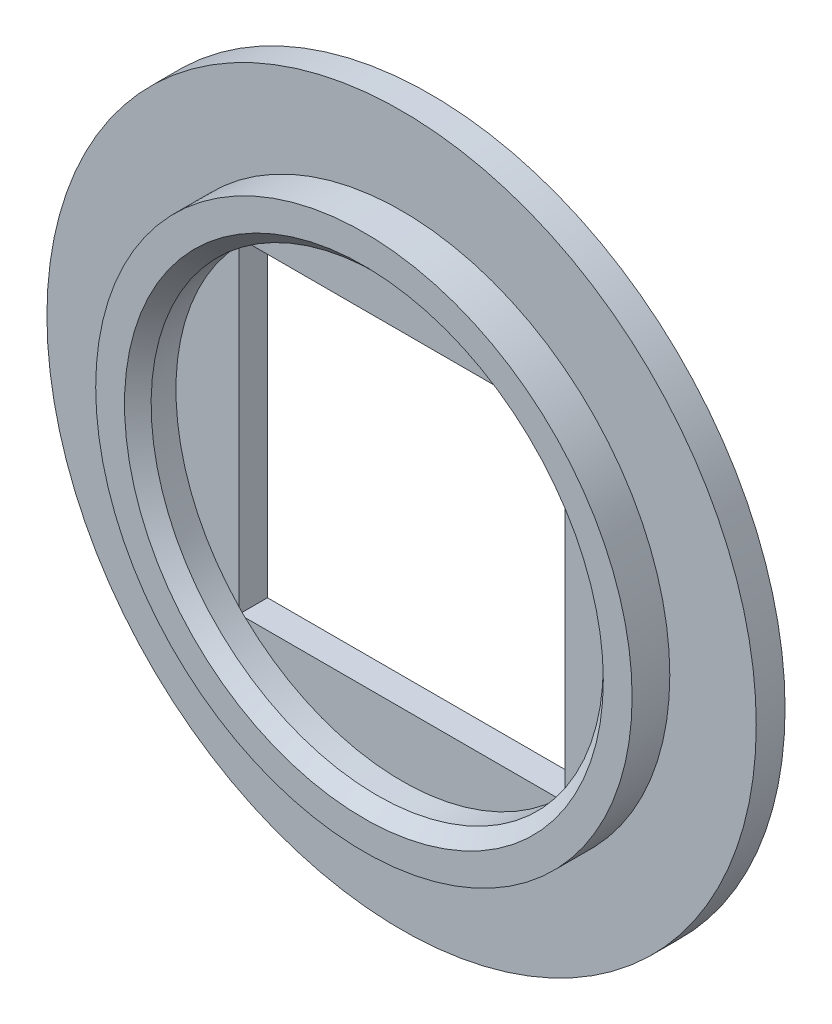
ISO-10303-21;
HEADER;
FILE_DESCRIPTION(('STEP AP214'),'2;1');
FILE_NAME('part.step','',(''),(''),'','','');
FILE_SCHEMA(('AUTOMOTIVE_DESIGN { 1 0 10303 214 1 1 1 1 }'));
ENDSEC;
DATA;
#1=APPLICATION_CONTEXT('core data for automotive mechanical design processes');
#2=APPLICATION_PROTOCOL_DEFINITION('international standard','automotive_design',2000,#1);
#3=PRODUCT_CONTEXT('',#1,'mechanical');
#4=PRODUCT('Part','Part','',(#3));
#5=PRODUCT_RELATED_PRODUCT_CATEGORY('part','',(#4));
#6=PRODUCT_DEFINITION_FORMATION('','',#4);
#7=PRODUCT_DEFINITION_CONTEXT('part definition',#1,'design');
#8=PRODUCT_DEFINITION('design','',#6,#7);
#9=PRODUCT_DEFINITION_SHAPE('','',#8);
#10=(LENGTH_UNIT() NAMED_UNIT(*) SI_UNIT(.MILLI.,.METRE.));
#11=(NAMED_UNIT(*) PLANE_ANGLE_UNIT() SI_UNIT($,.RADIAN.));
#12=(NAMED_UNIT(*) SI_UNIT($,.STERADIAN.) SOLID_ANGLE_UNIT());
#13=UNCERTAINTY_MEASURE_WITH_UNIT(LENGTH_MEASURE(1.E-05),#10,'distance_accuracy_value','');
#14=(GEOMETRIC_REPRESENTATION_CONTEXT(3) GLOBAL_UNCERTAINTY_ASSIGNED_CONTEXT((#13)) GLOBAL_UNIT_ASSIGNED_CONTEXT((#10,
#11,#12)) REPRESENTATION_CONTEXT('',''));
#15=CARTESIAN_POINT('',(0.,0.,0.));
#16=DIRECTION('',(0.,0.,1.));
#17=DIRECTION('',(1.,0.,0.));
#18=AXIS2_PLACEMENT_3D('',#15,#16,#17);
#19=CARTESIAN_POINT('',(0.,0.,0.64));
#20=DIRECTION('',(0.,0.,1.));
#21=DIRECTION('',(1.,0.,0.));
#22=AXIS2_PLACEMENT_3D('',#19,#20,#21);
#23=PLANE('',#22);
#24=DIRECTION('',(-1.,0.,0.));
#25=VECTOR('',#24,1.);
#26=CARTESIAN_POINT('',(-3.675,3.675,0.64));
#27=LINE('',#26,#25);
#28=CARTESIAN_POINT('',(3.53615257023788,3.675,0.64));
#29=VERTEX_POINT('',#28);
#30=CARTESIAN_POINT('',(-3.53615257023788,3.675,0.64));
#31=VERTEX_POINT('',#30);
#32=EDGE_CURVE('E143',#29,#31,#27,.T.);
#33=ORIENTED_EDGE('',*,*,#32,.F.);
#34=CARTESIAN_POINT('',(0.,0.,0.64));
#35=DIRECTION('',(0.,0.,1.));
#36=DIRECTION('',(1.,0.,0.));
#37=AXIS2_PLACEMENT_3D('',#34,#35,#36);
#38=CIRCLE('',#37,5.1);
#39=EDGE_CURVE('E216',#29,#31,#38,.T.);
#40=ORIENTED_EDGE('',*,*,#39,.T.);
#41=EDGE_LOOP('',(#33,#40));
#42=FACE_BOUND('',#41,.T.);
#43=ADVANCED_FACE('F45',(#42),#23,.T.);
#44=DIRECTION('',(0.,-1.,0.));
#45=VECTOR('',#44,1.);
#46=CARTESIAN_POINT('',(-3.675,0.,0.64));
#47=LINE('',#46,#45);
#48=CARTESIAN_POINT('',(-3.675,3.53615257023788,0.64));
#49=VERTEX_POINT('',#48);
#50=CARTESIAN_POINT('',(-3.675,-3.53615257023788,0.64));
#51=VERTEX_POINT('',#50);
#52=EDGE_CURVE('E150',#49,#51,#47,.T.);
#53=ORIENTED_EDGE('',*,*,#52,.F.);
#54=EDGE_CURVE('E204',#49,#51,#38,.T.);
#55=ORIENTED_EDGE('',*,*,#54,.T.);
#56=EDGE_LOOP('',(#53,#55));
#57=FACE_BOUND('',#56,.T.);
#58=ADVANCED_FACE('F210',(#57),#23,.T.);
#59=DIRECTION('',(1.,0.,0.));
#60=VECTOR('',#59,1.);
#61=CARTESIAN_POINT('',(3.675,-3.675,0.64));
#62=LINE('',#61,#60);
#63=CARTESIAN_POINT('',(-3.53615257023788,-3.675,0.64));
#64=VERTEX_POINT('',#63);
#65=CARTESIAN_POINT('',(3.53615257023788,-3.675,0.64));
#66=VERTEX_POINT('',#65);
#67=EDGE_CURVE('E180',#64,#66,#62,.T.);
#68=ORIENTED_EDGE('',*,*,#67,.F.);
#69=EDGE_CURVE('E207',#64,#66,#38,.T.);
#70=ORIENTED_EDGE('',*,*,#69,.T.);
#71=EDGE_LOOP('',(#68,#70));
#72=FACE_BOUND('',#71,.T.);
#73=ADVANCED_FACE('F256',(#72),#23,.T.);
#74=CARTESIAN_POINT('',(0.,0.,0.));
#75=DIRECTION('',(0.,0.,1.));
#76=DIRECTION('',(1.,0.,0.));
#77=AXIS2_PLACEMENT_3D('',#74,#75,#76);
#78=PLANE('',#77);
#79=CARTESIAN_POINT('',(0.,0.,0.));
#80=DIRECTION('',(0.,0.,1.));
#81=DIRECTION('',(1.,0.,0.));
#82=AXIS2_PLACEMENT_3D('',#79,#80,#81);
#83=CIRCLE('',#82,8.);
#84=CARTESIAN_POINT('',(8.,0.,0.));
#85=VERTEX_POINT('',#84);
#86=EDGE_CURVE('E224',#85,#85,#83,.T.);
#87=ORIENTED_EDGE('',*,*,#86,.F.);
#88=EDGE_LOOP('',(#87));
#89=FACE_BOUND('',#88,.T.);
#90=DIRECTION('',(0.,-1.,0.));
#91=VECTOR('',#90,1.);
#92=CARTESIAN_POINT('',(-3.675,0.,0.));
#93=LINE('',#92,#91);
#94=CARTESIAN_POINT('',(-3.675,3.675,0.));
#95=VERTEX_POINT('',#94);
#96=CARTESIAN_POINT('',(-3.675,-3.675,0.));
#97=VERTEX_POINT('',#96);
#98=EDGE_CURVE('E70',#95,#97,#93,.T.);
#99=ORIENTED_EDGE('',*,*,#98,.T.);
#100=DIRECTION('',(1.,0.,0.));
#101=VECTOR('',#100,1.);
#102=CARTESIAN_POINT('',(3.675,-3.675,0.));
#103=LINE('',#102,#101);
#104=CARTESIAN_POINT('',(3.675,-3.675,0.));
#105=VERTEX_POINT('',#104);
#106=EDGE_CURVE('E168',#97,#105,#103,.T.);
#107=ORIENTED_EDGE('',*,*,#106,.T.);
#108=DIRECTION('',(0.,1.,0.));
#109=VECTOR('',#108,1.);
#110=CARTESIAN_POINT('',(3.675,3.675,0.));
#111=LINE('',#110,#109);
#112=CARTESIAN_POINT('',(3.675,3.675,0.));
#113=VERTEX_POINT('',#112);
#114=EDGE_CURVE('E136',#105,#113,#111,.T.);
#115=ORIENTED_EDGE('',*,*,#114,.T.);
#116=DIRECTION('',(-1.,0.,0.));
#117=VECTOR('',#116,1.);
#118=CARTESIAN_POINT('',(-3.675,3.675,0.));
#119=LINE('',#118,#117);
#120=EDGE_CURVE('E133',#113,#95,#119,.T.);
#121=ORIENTED_EDGE('',*,*,#120,.T.);
#122=EDGE_LOOP('',(#99,#107,#115,#121));
#123=FACE_BOUND('',#122,.T.);
#124=ADVANCED_FACE('F267',(#89,#123),#78,.F.);
#125=CARTESIAN_POINT('',(0.,0.,0.65));
#126=DIRECTION('',(0.,0.,-1.));
#127=DIRECTION('',(-1.,0.,0.));
#128=AXIS2_PLACEMENT_3D('',#125,#126,#127);
#129=CYLINDRICAL_SURFACE('',#128,8.);
#130=CARTESIAN_POINT('',(0.,0.,0.65));
#131=DIRECTION('',(0.,0.,1.));
#132=DIRECTION('',(1.,0.,0.));
#133=AXIS2_PLACEMENT_3D('',#130,#131,#132);
#134=CIRCLE('',#133,8.);
#135=CARTESIAN_POINT('',(8.,0.,0.65));
#136=VERTEX_POINT('',#135);
#137=EDGE_CURVE('E228',#136,#136,#134,.T.);
#138=ORIENTED_EDGE('',*,*,#137,.F.);
#139=EDGE_LOOP('',(#138));
#140=FACE_BOUND('',#139,.T.);
#141=ORIENTED_EDGE('',*,*,#86,.T.);
#142=EDGE_LOOP('',(#141));
#143=FACE_BOUND('',#142,.T.);
#144=ADVANCED_FACE('F272',(#140,#143),#129,.T.);
#145=CARTESIAN_POINT('',(0.,0.,0.65));
#146=DIRECTION('',(0.,0.,1.));
#147=DIRECTION('',(1.,0.,0.));
#148=AXIS2_PLACEMENT_3D('',#145,#146,#147);
#149=PLANE('',#148);
#150=CARTESIAN_POINT('',(0.,0.,0.65));
#151=DIRECTION('',(0.,0.,1.));
#152=DIRECTION('',(1.,0.,0.));
#153=AXIS2_PLACEMENT_3D('',#150,#151,#152);
#154=CIRCLE('',#153,6.05);
#155=CARTESIAN_POINT('',(6.05,0.,0.65));
#156=VERTEX_POINT('',#155);
#157=EDGE_CURVE('E219',#156,#156,#154,.T.);
#158=ORIENTED_EDGE('',*,*,#157,.F.);
#159=EDGE_LOOP('',(#158));
#160=FACE_BOUND('',#159,.T.);
#161=ORIENTED_EDGE('',*,*,#137,.T.);
#162=EDGE_LOOP('',(#161));
#163=FACE_BOUND('',#162,.T.);
#164=ADVANCED_FACE('F355',(#160,#163),#149,.T.);
#165=CARTESIAN_POINT('',(0.,0.,1.5));
#166=DIRECTION('',(0.,0.,1.));
#167=DIRECTION('',(1.,0.,0.));
#168=AXIS2_PLACEMENT_3D('',#165,#166,#167);
#169=PLANE('',#168);
#170=CARTESIAN_POINT('',(0.,0.,1.5));
#171=DIRECTION('',(0.,0.,1.));
#172=DIRECTION('',(1.,0.,0.));
#173=AXIS2_PLACEMENT_3D('',#170,#171,#172);
#174=CIRCLE('',#173,5.40000000000001);
#175=CARTESIAN_POINT('',(5.40000000000001,0.,1.5));
#176=VERTEX_POINT('',#175);
#177=EDGE_CURVE('E11',#176,#176,#174,.F.);
#178=ORIENTED_EDGE('',*,*,#177,.T.);
#179=EDGE_LOOP('',(#178));
#180=FACE_BOUND('',#179,.T.);
#181=CARTESIAN_POINT('',(0.,0.,1.5));
#182=DIRECTION('',(0.,0.,1.));
#183=DIRECTION('',(1.,0.,0.));
#184=AXIS2_PLACEMENT_3D('',#181,#182,#183);
#185=CIRCLE('',#184,6.05);
#186=CARTESIAN_POINT('',(6.05,0.,1.5));
#187=VERTEX_POINT('',#186);
#188=EDGE_CURVE('E220',#187,#187,#185,.T.);
#189=ORIENTED_EDGE('',*,*,#188,.T.);
#190=EDGE_LOOP('',(#189));
#191=FACE_BOUND('',#190,.T.);
#192=ADVANCED_FACE('F350',(#180,#191),#169,.T.);
#193=CARTESIAN_POINT('',(0.,0.,1.5));
#194=DIRECTION('',(0.,0.,-1.));
#195=DIRECTION('',(-1.,0.,0.));
#196=AXIS2_PLACEMENT_3D('',#193,#194,#195);
#197=CYLINDRICAL_SURFACE('',#196,6.05);
#198=ORIENTED_EDGE('',*,*,#188,.F.);
#199=EDGE_LOOP('',(#198));
#200=FACE_BOUND('',#199,.T.);
#201=ORIENTED_EDGE('',*,*,#157,.T.);
#202=EDGE_LOOP('',(#201));
#203=FACE_BOUND('',#202,.T.);
#204=ADVANCED_FACE('F265',(#200,#203),#197,.T.);
#205=CARTESIAN_POINT('',(0.,0.,1.5));
#206=DIRECTION('',(0.,0.,-1.));
#207=DIRECTION('',(-1.,0.,0.));
#208=AXIS2_PLACEMENT_3D('',#205,#206,#207);
#209=CYLINDRICAL_SURFACE('',#208,5.1);
#210=CARTESIAN_POINT('',(0.,0.,1.2));
#211=DIRECTION('',(0.,0.,1.));
#212=DIRECTION('',(1.,0.,0.));
#213=AXIS2_PLACEMENT_3D('',#210,#211,#212);
#214=CIRCLE('',#213,5.1);
#215=CARTESIAN_POINT('',(5.1,0.,1.2));
#216=VERTEX_POINT('',#215);
#217=EDGE_CURVE('E55',#216,#216,#214,.T.);
#218=ORIENTED_EDGE('',*,*,#217,.T.);
#219=EDGE_LOOP('',(#218));
#220=FACE_BOUND('',#219,.T.);
#221=CARTESIAN_POINT('',(3.675,3.53615257023789,0.64));
#222=VERTEX_POINT('',#221);
#223=EDGE_CURVE('E140',#222,#29,#38,.T.);
#224=ORIENTED_EDGE('',*,*,#223,.F.);
#225=CARTESIAN_POINT('',(3.675,-3.53615257023788,0.64));
#226=VERTEX_POINT('',#225);
#227=EDGE_CURVE('E177',#226,#222,#38,.T.);
#228=ORIENTED_EDGE('',*,*,#227,.F.);
#229=EDGE_CURVE('E282',#66,#226,#38,.T.);
#230=ORIENTED_EDGE('',*,*,#229,.F.);
#231=ORIENTED_EDGE('',*,*,#69,.F.);
#232=EDGE_CURVE('E201',#51,#64,#38,.T.);
#233=ORIENTED_EDGE('',*,*,#232,.F.);
#234=ORIENTED_EDGE('',*,*,#54,.F.);
#235=EDGE_CURVE('E212',#31,#49,#38,.T.);
#236=ORIENTED_EDGE('',*,*,#235,.F.);
#237=ORIENTED_EDGE('',*,*,#39,.F.);
#238=EDGE_LOOP('',(#224,#228,#230,#231,#233,#234,#236,#237));
#239=FACE_BOUND('',#238,.T.);
#240=ADVANCED_FACE('F202',(#220,#239),#209,.F.);
#241=DIRECTION('',(0.,1.,0.));
#242=VECTOR('',#241,1.);
#243=CARTESIAN_POINT('',(3.675,3.675,0.64));
#244=LINE('',#243,#242);
#245=EDGE_CURVE('E119',#226,#222,#244,.T.);
#246=ORIENTED_EDGE('',*,*,#245,.F.);
#247=ORIENTED_EDGE('',*,*,#227,.T.);
#248=EDGE_LOOP('',(#246,#247));
#249=FACE_BOUND('',#248,.T.);
#250=ADVANCED_FACE('F252',(#249),#23,.T.);
#251=CARTESIAN_POINT('',(0.,0.,0.64));
#252=DIRECTION('',(0.,0.,1.));
#253=DIRECTION('',(1.,0.,0.));
#254=AXIS2_PLACEMENT_3D('',#251,#252,#253);
#255=PLANE('',#254);
#256=ORIENTED_EDGE('',*,*,#223,.T.);
#257=CARTESIAN_POINT('',(3.675,3.675,0.64));
#258=VERTEX_POINT('',#257);
#259=EDGE_CURVE('E130',#258,#29,#27,.T.);
#260=ORIENTED_EDGE('',*,*,#259,.F.);
#261=EDGE_CURVE('E112',#222,#258,#244,.T.);
#262=ORIENTED_EDGE('',*,*,#261,.F.);
#263=EDGE_LOOP('',(#256,#260,#262));
#264=FACE_BOUND('',#263,.T.);
#265=ADVANCED_FACE('F138',(#264),#255,.F.);
#266=ORIENTED_EDGE('',*,*,#235,.T.);
#267=CARTESIAN_POINT('',(-3.675,3.675,0.64));
#268=VERTEX_POINT('',#267);
#269=EDGE_CURVE('E152',#268,#49,#47,.T.);
#270=ORIENTED_EDGE('',*,*,#269,.F.);
#271=EDGE_CURVE('E145',#31,#268,#27,.T.);
#272=ORIENTED_EDGE('',*,*,#271,.F.);
#273=EDGE_LOOP('',(#266,#270,#272));
#274=FACE_BOUND('',#273,.T.);
#275=ADVANCED_FACE('F264',(#274),#255,.F.);
#276=ORIENTED_EDGE('',*,*,#232,.T.);
#277=CARTESIAN_POINT('',(-3.675,-3.675,0.64));
#278=VERTEX_POINT('',#277);
#279=EDGE_CURVE('E124',#278,#64,#62,.T.);
#280=ORIENTED_EDGE('',*,*,#279,.F.);
#281=EDGE_CURVE('E142',#51,#278,#47,.T.);
#282=ORIENTED_EDGE('',*,*,#281,.F.);
#283=EDGE_LOOP('',(#276,#280,#282));
#284=FACE_BOUND('',#283,.T.);
#285=ADVANCED_FACE('F247',(#284),#255,.F.);
#286=CARTESIAN_POINT('',(-3.675,0.,11.0344696834422));
#287=DIRECTION('',(1.,0.,0.));
#288=DIRECTION('',(0.,0.,-1.));
#289=AXIS2_PLACEMENT_3D('',#286,#287,#288);
#290=PLANE('',#289);
#291=ORIENTED_EDGE('',*,*,#269,.T.);
#292=ORIENTED_EDGE('',*,*,#52,.T.);
#293=ORIENTED_EDGE('',*,*,#281,.T.);
#294=DIRECTION('',(0.,0.,-1.));
#295=VECTOR('',#294,1.);
#296=CARTESIAN_POINT('',(-3.675,-3.675,11.0344696834422));
#297=LINE('',#296,#295);
#298=EDGE_CURVE('E172',#278,#97,#297,.T.);
#299=ORIENTED_EDGE('',*,*,#298,.T.);
#300=ORIENTED_EDGE('',*,*,#98,.F.);
#301=DIRECTION('',(0.,0.,-1.));
#302=VECTOR('',#301,1.);
#303=CARTESIAN_POINT('',(-3.675,3.675,11.0344696834422));
#304=LINE('',#303,#302);
#305=EDGE_CURVE('E174',#268,#95,#304,.T.);
#306=ORIENTED_EDGE('',*,*,#305,.F.);
#307=EDGE_LOOP('',(#291,#292,#293,#299,#300,#306));
#308=FACE_BOUND('',#307,.T.);
#309=ADVANCED_FACE('F194',(#308),#290,.T.);
#310=CARTESIAN_POINT('',(3.675,-3.675,11.0344696834422));
#311=DIRECTION('',(0.,1.,0.));
#312=DIRECTION('',(-1.,0.,0.));
#313=AXIS2_PLACEMENT_3D('',#310,#311,#312);
#314=PLANE('',#313);
#315=ORIENTED_EDGE('',*,*,#279,.T.);
#316=ORIENTED_EDGE('',*,*,#67,.T.);
#317=CARTESIAN_POINT('',(3.675,-3.675,0.64));
#318=VERTEX_POINT('',#317);
#319=EDGE_CURVE('E181',#66,#318,#62,.T.);
#320=ORIENTED_EDGE('',*,*,#319,.T.);
#321=DIRECTION('',(0.,0.,-1.));
#322=VECTOR('',#321,1.);
#323=CARTESIAN_POINT('',(3.675,-3.675,11.0344696834422));
#324=LINE('',#323,#322);
#325=EDGE_CURVE('E167',#318,#105,#324,.T.);
#326=ORIENTED_EDGE('',*,*,#325,.T.);
#327=ORIENTED_EDGE('',*,*,#106,.F.);
#328=ORIENTED_EDGE('',*,*,#298,.F.);
#329=EDGE_LOOP('',(#315,#316,#320,#326,#327,#328));
#330=FACE_BOUND('',#329,.T.);
#331=ADVANCED_FACE('F314',(#330),#314,.T.);
#332=CARTESIAN_POINT('',(3.675,3.675,11.0344696834422));
#333=DIRECTION('',(-1.,0.,0.));
#334=DIRECTION('',(0.,-1.,0.));
#335=AXIS2_PLACEMENT_3D('',#332,#333,#334);
#336=PLANE('',#335);
#337=EDGE_CURVE('E62',#318,#226,#244,.T.);
#338=ORIENTED_EDGE('',*,*,#337,.T.);
#339=ORIENTED_EDGE('',*,*,#245,.T.);
#340=ORIENTED_EDGE('',*,*,#261,.T.);
#341=DIRECTION('',(0.,0.,-1.));
#342=VECTOR('',#341,1.);
#343=CARTESIAN_POINT('',(3.675,3.675,11.0344696834422));
#344=LINE('',#343,#342);
#345=EDGE_CURVE('E116',#258,#113,#344,.T.);
#346=ORIENTED_EDGE('',*,*,#345,.T.);
#347=ORIENTED_EDGE('',*,*,#114,.F.);
#348=ORIENTED_EDGE('',*,*,#325,.F.);
#349=EDGE_LOOP('',(#338,#339,#340,#346,#347,#348));
#350=FACE_BOUND('',#349,.T.);
#351=ADVANCED_FACE('F114',(#350),#336,.T.);
#352=CARTESIAN_POINT('',(-3.675,3.675,11.0344696834422));
#353=DIRECTION('',(0.,-1.,0.));
#354=DIRECTION('',(0.,0.,-1.));
#355=AXIS2_PLACEMENT_3D('',#352,#353,#354);
#356=PLANE('',#355);
#357=ORIENTED_EDGE('',*,*,#259,.T.);
#358=ORIENTED_EDGE('',*,*,#32,.T.);
#359=ORIENTED_EDGE('',*,*,#271,.T.);
#360=ORIENTED_EDGE('',*,*,#305,.T.);
#361=ORIENTED_EDGE('',*,*,#120,.F.);
#362=ORIENTED_EDGE('',*,*,#345,.F.);
#363=EDGE_LOOP('',(#357,#358,#359,#360,#361,#362));
#364=FACE_BOUND('',#363,.T.);
#365=ADVANCED_FACE('F128',(#364),#356,.T.);
#366=ORIENTED_EDGE('',*,*,#229,.T.);
#367=ORIENTED_EDGE('',*,*,#337,.F.);
#368=ORIENTED_EDGE('',*,*,#319,.F.);
#369=EDGE_LOOP('',(#366,#367,#368));
#370=FACE_BOUND('',#369,.T.);
#371=ADVANCED_FACE('F240',(#370),#255,.F.);
#372=CARTESIAN_POINT('',(0.,0.,1.2));
#373=DIRECTION('',(0.,0.,1.));
#374=DIRECTION('',(1.,0.,0.));
#375=AXIS2_PLACEMENT_3D('',#372,#373,#374);
#376=CONICAL_SURFACE('',#375,5.1,0.785398163397457);
#377=ORIENTED_EDGE('',*,*,#177,.F.);
#378=EDGE_LOOP('',(#377));
#379=FACE_BOUND('',#378,.T.);
#380=ORIENTED_EDGE('',*,*,#217,.F.);
#381=EDGE_LOOP('',(#380));
#382=FACE_BOUND('',#381,.T.);
#383=ADVANCED_FACE('F48',(#379,#382),#376,.F.);
#384=CLOSED_SHELL('',(#43,#58,#73,#124,#144,#164,#192,#204,#240,#250,#265,#275,#285,#309,#331,
#351,#365,#371,#383));
#385=MANIFOLD_SOLID_BREP('B2',#384);
#386=ADVANCED_BREP_SHAPE_REPRESENTATION('',(#18,#385),#14);
#387=SHAPE_DEFINITION_REPRESENTATION(#9,#386);
ENDSEC;
END-ISO-10303-21;
